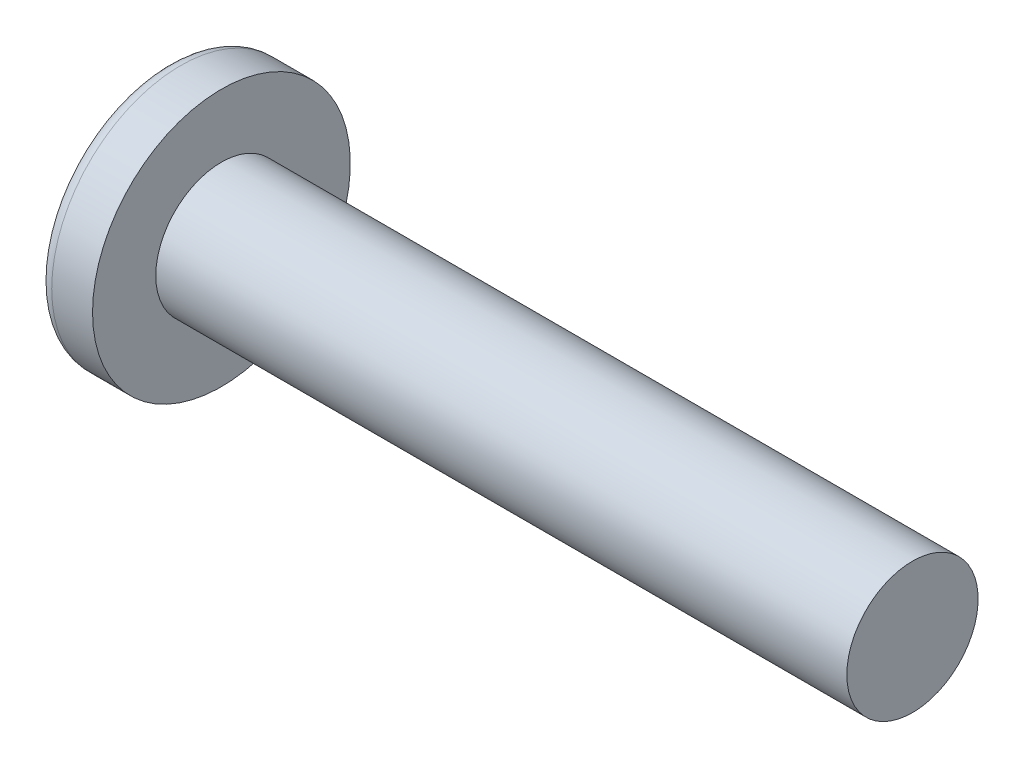
ISO-10303-21;
HEADER;
FILE_DESCRIPTION(('STEP AP214'),'2;1');
FILE_NAME('part.step','',(''),(''),'','','');
FILE_SCHEMA(('AUTOMOTIVE_DESIGN { 1 0 10303 214 1 1 1 1 }'));
ENDSEC;
DATA;
#1=APPLICATION_CONTEXT('core data for automotive mechanical design processes');
#2=APPLICATION_PROTOCOL_DEFINITION('international standard','automotive_design',2000,#1);
#3=PRODUCT_CONTEXT('',#1,'mechanical');
#4=PRODUCT('Part','Part','',(#3));
#5=PRODUCT_RELATED_PRODUCT_CATEGORY('part','',(#4));
#6=PRODUCT_DEFINITION_FORMATION('','',#4);
#7=PRODUCT_DEFINITION_CONTEXT('part definition',#1,'design');
#8=PRODUCT_DEFINITION('design','',#6,#7);
#9=PRODUCT_DEFINITION_SHAPE('','',#8);
#10=(LENGTH_UNIT() NAMED_UNIT(*) SI_UNIT(.MILLI.,.METRE.));
#11=(NAMED_UNIT(*) PLANE_ANGLE_UNIT() SI_UNIT($,.RADIAN.));
#12=(NAMED_UNIT(*) SI_UNIT($,.STERADIAN.) SOLID_ANGLE_UNIT());
#13=UNCERTAINTY_MEASURE_WITH_UNIT(LENGTH_MEASURE(1.E-05),#10,'distance_accuracy_value','');
#14=(GEOMETRIC_REPRESENTATION_CONTEXT(3) GLOBAL_UNCERTAINTY_ASSIGNED_CONTEXT((#13)) GLOBAL_UNIT_ASSIGNED_CONTEXT((#10,
#11,#12)) REPRESENTATION_CONTEXT('',''));
#15=CARTESIAN_POINT('',(0.,0.,0.));
#16=DIRECTION('',(0.,0.,1.));
#17=DIRECTION('',(1.,0.,0.));
#18=AXIS2_PLACEMENT_3D('',#15,#16,#17);
#19=CARTESIAN_POINT('',(7.7216,0.,0.));
#20=DIRECTION('',(-1.,0.,0.));
#21=DIRECTION('',(0.,1.,0.));
#22=AXIS2_PLACEMENT_3D('',#19,#20,#21);
#23=SPHERICAL_SURFACE('',#22,7.7216);
#24=CARTESIAN_POINT('',(1.46619704189251,0.,0.));
#25=DIRECTION('',(-1.,0.,0.));
#26=DIRECTION('',(0.,0.,1.));
#27=AXIS2_PLACEMENT_3D('',#24,#25,#26);
#28=CIRCLE('',#27,4.52692394366197);
#29=CARTESIAN_POINT('',(1.46619704189251,0.,4.52692394366197));
#30=VERTEX_POINT('',#29);
#31=EDGE_CURVE('E153',#30,#30,#28,.T.);
#32=ORIENTED_EDGE('',*,*,#31,.T.);
#33=EDGE_LOOP('',(#32));
#34=FACE_BOUND('',#33,.T.);
#35=CARTESIAN_POINT('',(7.71626836849415,-0.0635159579392896,0.));
#36=DIRECTION('',(-0.0836474251843073,-0.996495413065226,0.));
#37=DIRECTION('',(0.996495413065226,-0.0836474251843073,0.));
#38=AXIS2_PLACEMENT_3D('',#35,#36,#37);
#39=CIRCLE('',#38,7.72133692159541);
#40=CARTESIAN_POINT('',(0.492297297865042,0.542875774266794,2.65811491373462));
#41=VERTEX_POINT('',#40);
#42=CARTESIAN_POINT('',(0.0437691983649017,0.580525943202944,0.580525943202946));
#43=VERTEX_POINT('',#42);
#44=EDGE_CURVE('E184',#41,#43,#39,.T.);
#45=ORIENTED_EDGE('',*,*,#44,.F.);
#46=CARTESIAN_POINT('',(6.22874657717022,0.,-1.88498542790488));
#47=DIRECTION('',(0.620849497837048,0.,0.783929780679038));
#48=DIRECTION('',(0.783929780679038,0.,-0.620849497837048));
#49=AXIS2_PLACEMENT_3D('',#46,#47,#48);
#50=CIRCLE('',#49,7.33766482980326);
#51=CARTESIAN_POINT('',(0.492297297865042,-0.542875774266812,2.65811491373462));
#52=VERTEX_POINT('',#51);
#53=EDGE_CURVE('E149',#41,#52,#50,.T.);
#54=ORIENTED_EDGE('',*,*,#53,.T.);
#55=CARTESIAN_POINT('',(7.71626836849415,0.0635159579392893,0.));
#56=DIRECTION('',(-0.0836474251843072,0.996495413065226,0.));
#57=DIRECTION('',(-0.996495413065226,-0.0836474251843072,0.));
#58=AXIS2_PLACEMENT_3D('',#55,#56,#57);
#59=CIRCLE('',#58,7.72133692159541);
#60=CARTESIAN_POINT('',(0.0437691983649017,-0.580525943202948,0.580525943202946));
#61=VERTEX_POINT('',#60);
#62=EDGE_CURVE('E105',#61,#52,#59,.T.);
#63=ORIENTED_EDGE('',*,*,#62,.F.);
#64=CARTESIAN_POINT('',(7.71626836849415,0.,-0.0635159579392893));
#65=DIRECTION('',(-0.0836474251843072,0.,-0.996495413065226));
#66=DIRECTION('',(-0.996495413065226,0.,0.0836474251843072));
#67=AXIS2_PLACEMENT_3D('',#64,#65,#66);
#68=CIRCLE('',#67,7.72133692159541);
#69=CARTESIAN_POINT('',(0.492297297865041,-2.65811491373462,0.542875774266802));
#70=VERTEX_POINT('',#69);
#71=EDGE_CURVE('E130',#70,#61,#68,.T.);
#72=ORIENTED_EDGE('',*,*,#71,.F.);
#73=CARTESIAN_POINT('',(6.22874657717022,1.88498542790488,0.));
#74=DIRECTION('',(0.620849497837048,-0.783929780679038,0.));
#75=DIRECTION('',(0.783929780679038,0.620849497837048,0.));
#76=AXIS2_PLACEMENT_3D('',#73,#74,#75);
#77=CIRCLE('',#76,7.33766482980326);
#78=CARTESIAN_POINT('',(0.492297297865041,-2.65811491373462,-0.542875774266803));
#79=VERTEX_POINT('',#78);
#80=EDGE_CURVE('E138',#70,#79,#77,.T.);
#81=ORIENTED_EDGE('',*,*,#80,.T.);
#82=CARTESIAN_POINT('',(7.71626836849415,0.,0.0635159579392897));
#83=DIRECTION('',(-0.0836474251843073,0.,0.996495413065226));
#84=DIRECTION('',(0.996495413065226,0.,0.0836474251843073));
#85=AXIS2_PLACEMENT_3D('',#82,#83,#84);
#86=CIRCLE('',#85,7.72133692159541);
#87=CARTESIAN_POINT('',(0.0437691983649017,-0.580525943202944,-0.580525943202946));
#88=VERTEX_POINT('',#87);
#89=EDGE_CURVE('E48',#88,#79,#86,.T.);
#90=ORIENTED_EDGE('',*,*,#89,.F.);
#91=CARTESIAN_POINT('',(0.492297297865041,-0.542875774266793,-2.65811491373462));
#92=VERTEX_POINT('',#91);
#93=EDGE_CURVE('E191',#92,#88,#59,.T.);
#94=ORIENTED_EDGE('',*,*,#93,.F.);
#95=CARTESIAN_POINT('',(6.22874657717022,0.,1.88498542790488));
#96=DIRECTION('',(0.620849497837048,0.,-0.783929780679038));
#97=DIRECTION('',(-0.783929780679038,0.,-0.620849497837048));
#98=AXIS2_PLACEMENT_3D('',#95,#96,#97);
#99=CIRCLE('',#98,7.33766482980326);
#100=CARTESIAN_POINT('',(0.492297297865041,0.542875774266812,-2.65811491373462));
#101=VERTEX_POINT('',#100);
#102=EDGE_CURVE('E131',#92,#101,#99,.T.);
#103=ORIENTED_EDGE('',*,*,#102,.T.);
#104=CARTESIAN_POINT('',(0.0437691983649017,0.580525943202948,-0.580525943202946));
#105=VERTEX_POINT('',#104);
#106=EDGE_CURVE('E179',#105,#101,#39,.T.);
#107=ORIENTED_EDGE('',*,*,#106,.F.);
#108=CARTESIAN_POINT('',(0.492297297865042,2.65811491373462,-0.542875774266803));
#109=VERTEX_POINT('',#108);
#110=EDGE_CURVE('E41',#109,#105,#86,.T.);
#111=ORIENTED_EDGE('',*,*,#110,.F.);
#112=CARTESIAN_POINT('',(6.22874657717022,-1.88498542790488,0.));
#113=DIRECTION('',(0.620849497837048,0.783929780679038,0.));
#114=DIRECTION('',(-0.783929780679038,0.620849497837048,0.));
#115=AXIS2_PLACEMENT_3D('',#112,#113,#114);
#116=CIRCLE('',#115,7.33766482980326);
#117=CARTESIAN_POINT('',(0.492297297865042,2.65811491373462,0.542875774266803));
#118=VERTEX_POINT('',#117);
#119=EDGE_CURVE('E11',#109,#118,#116,.T.);
#120=ORIENTED_EDGE('',*,*,#119,.T.);
#121=EDGE_CURVE('E167',#43,#118,#68,.T.);
#122=ORIENTED_EDGE('',*,*,#121,.F.);
#123=EDGE_LOOP('',(#45,#54,#63,#72,#81,#90,#94,#103,#107,#111,#120,#122));
#124=FACE_BOUND('',#123,.T.);
#125=ADVANCED_FACE('F33',(#34,#124),#23,.T.);
#126=CARTESIAN_POINT('',(3.8486267281106,0.,-0.261140092165899));
#127=DIRECTION('',(-0.0836474251843073,0.,0.996495413065226));
#128=DIRECTION('',(0.996495413065226,0.,0.0836474251843073));
#129=AXIS2_PLACEMENT_3D('',#126,#127,#128);
#130=PLANE('',#129);
#131=ORIENTED_EDGE('',*,*,#110,.T.);
#132=DIRECTION('',(0.993027416127926,-0.0833563159523445,0.0833563159523442));
#133=VECTOR('',#132,1.);
#134=CARTESIAN_POINT('',(3.87024262719418,0.259325618885161,-0.25932561888516));
#135=LINE('',#134,#133);
#136=CARTESIAN_POINT('',(3.4798,0.292100000000001,-0.292099999999999));
#137=VERTEX_POINT('',#136);
#138=EDGE_CURVE('E173',#105,#137,#135,.T.);
#139=ORIENTED_EDGE('',*,*,#138,.T.);
#140=DIRECTION('',(0.782237983126563,-0.619509643571037,0.0656623124522297));
#141=VECTOR('',#140,1.);
#142=CARTESIAN_POINT('',(0.,3.048,-0.5842));
#143=LINE('',#142,#141);
#144=EDGE_CURVE('E154',#109,#137,#143,.T.);
#145=ORIENTED_EDGE('',*,*,#144,.F.);
#146=EDGE_LOOP('',(#131,#139,#145));
#147=FACE_BOUND('',#146,.T.);
#148=ADVANCED_FACE('F172',(#147),#130,.T.);
#149=DIRECTION('',(0.782237983126563,0.619509643571037,0.0656623124522297));
#150=VECTOR('',#149,1.);
#151=CARTESIAN_POINT('',(0.,-3.048,-0.5842));
#152=LINE('',#151,#150);
#153=CARTESIAN_POINT('',(3.4798,-0.2921,-0.2921));
#154=VERTEX_POINT('',#153);
#155=EDGE_CURVE('E139',#79,#154,#152,.T.);
#156=ORIENTED_EDGE('',*,*,#155,.T.);
#157=DIRECTION('',(-0.993027416127926,-0.0833563159523438,-0.0833563159523442));
#158=VECTOR('',#157,1.);
#159=CARTESIAN_POINT('',(3.87024262719418,-0.259325618885159,-0.25932561888516));
#160=LINE('',#159,#158);
#161=EDGE_CURVE('E194',#154,#88,#160,.T.);
#162=ORIENTED_EDGE('',*,*,#161,.T.);
#163=ORIENTED_EDGE('',*,*,#89,.T.);
#164=EDGE_LOOP('',(#156,#162,#163));
#165=FACE_BOUND('',#164,.T.);
#166=ADVANCED_FACE('F209',(#165),#130,.T.);
#167=CARTESIAN_POINT('',(3.8486267281106,0.,0.261140092165899));
#168=DIRECTION('',(-0.0836474251843072,0.,-0.996495413065226));
#169=DIRECTION('',(-0.996495413065226,0.,0.0836474251843072));
#170=AXIS2_PLACEMENT_3D('',#167,#168,#169);
#171=PLANE('',#170);
#172=DIRECTION('',(0.782237983126563,-0.619509643571037,-0.0656623124522297));
#173=VECTOR('',#172,1.);
#174=CARTESIAN_POINT('',(0.,3.048,0.5842));
#175=LINE('',#174,#173);
#176=CARTESIAN_POINT('',(3.4798,0.2921,0.2921));
#177=VERTEX_POINT('',#176);
#178=EDGE_CURVE('E210',#118,#177,#175,.T.);
#179=ORIENTED_EDGE('',*,*,#178,.T.);
#180=DIRECTION('',(-0.993027416127926,0.0833563159523439,0.0833563159523441));
#181=VECTOR('',#180,1.);
#182=CARTESIAN_POINT('',(3.87024262719418,0.259325618885159,0.25932561888516));
#183=LINE('',#182,#181);
#184=EDGE_CURVE('E188',#177,#43,#183,.T.);
#185=ORIENTED_EDGE('',*,*,#184,.T.);
#186=ORIENTED_EDGE('',*,*,#121,.T.);
#187=EDGE_LOOP('',(#179,#185,#186));
#188=FACE_BOUND('',#187,.T.);
#189=ADVANCED_FACE('F214',(#188),#171,.T.);
#190=ORIENTED_EDGE('',*,*,#71,.T.);
#191=DIRECTION('',(0.993027416127926,0.0833563159523444,-0.0833563159523441));
#192=VECTOR('',#191,1.);
#193=CARTESIAN_POINT('',(3.87024262719418,-0.259325618885161,0.25932561888516));
#194=LINE('',#193,#192);
#195=CARTESIAN_POINT('',(3.4798,-0.292100000000001,0.292099999999999));
#196=VERTEX_POINT('',#195);
#197=EDGE_CURVE('E103',#61,#196,#194,.T.);
#198=ORIENTED_EDGE('',*,*,#197,.T.);
#199=DIRECTION('',(0.782237983126563,0.619509643571037,-0.0656623124522295));
#200=VECTOR('',#199,1.);
#201=CARTESIAN_POINT('',(0.,-3.048,0.584199999999999));
#202=LINE('',#201,#200);
#203=EDGE_CURVE('E128',#70,#196,#202,.T.);
#204=ORIENTED_EDGE('',*,*,#203,.F.);
#205=EDGE_LOOP('',(#190,#198,#204));
#206=FACE_BOUND('',#205,.T.);
#207=ADVANCED_FACE('F127',(#206),#171,.T.);
#208=CARTESIAN_POINT('',(-25.4,0.,0.));
#209=DIRECTION('',(-1.,0.,0.));
#210=DIRECTION('',(0.,0.,1.));
#211=AXIS2_PLACEMENT_3D('',#208,#209,#210);
#212=CYLINDRICAL_SURFACE('',#211,2.413);
#213=CARTESIAN_POINT('',(28.7782,0.,0.));
#214=DIRECTION('',(-1.,0.,0.));
#215=DIRECTION('',(0.,0.,1.));
#216=AXIS2_PLACEMENT_3D('',#213,#214,#215);
#217=CIRCLE('',#216,2.413);
#218=CARTESIAN_POINT('',(28.7782,0.,2.413));
#219=VERTEX_POINT('',#218);
#220=EDGE_CURVE('E150',#219,#219,#217,.T.);
#221=ORIENTED_EDGE('',*,*,#220,.T.);
#222=EDGE_LOOP('',(#221));
#223=FACE_BOUND('',#222,.T.);
#224=CARTESIAN_POINT('',(3.3782,0.,0.));
#225=DIRECTION('',(-1.,0.,0.));
#226=DIRECTION('',(0.,0.,1.));
#227=AXIS2_PLACEMENT_3D('',#224,#225,#226);
#228=CIRCLE('',#227,2.413);
#229=CARTESIAN_POINT('',(3.3782,0.,2.413));
#230=VERTEX_POINT('',#229);
#231=EDGE_CURVE('E163',#230,#230,#228,.T.);
#232=ORIENTED_EDGE('',*,*,#231,.F.);
#233=EDGE_LOOP('',(#232));
#234=FACE_BOUND('',#233,.T.);
#235=ADVANCED_FACE('F35',(#223,#234),#212,.T.);
#236=CARTESIAN_POINT('',(3.3782,2.413,0.));
#237=DIRECTION('',(-1.,0.,0.));
#238=DIRECTION('',(0.,0.,1.));
#239=AXIS2_PLACEMENT_3D('',#236,#237,#238);
#240=PLANE('',#239);
#241=CARTESIAN_POINT('',(3.3782,0.,0.));
#242=DIRECTION('',(-1.,0.,0.));
#243=DIRECTION('',(0.,0.,1.));
#244=AXIS2_PLACEMENT_3D('',#241,#242,#243);
#245=CIRCLE('',#244,4.7371);
#246=CARTESIAN_POINT('',(3.3782,0.,4.7371));
#247=VERTEX_POINT('',#246);
#248=EDGE_CURVE('E160',#247,#247,#245,.T.);
#249=ORIENTED_EDGE('',*,*,#248,.F.);
#250=EDGE_LOOP('',(#249));
#251=FACE_BOUND('',#250,.T.);
#252=ORIENTED_EDGE('',*,*,#231,.T.);
#253=EDGE_LOOP('',(#252));
#254=FACE_BOUND('',#253,.T.);
#255=ADVANCED_FACE('F242',(#251,#254),#240,.F.);
#256=CARTESIAN_POINT('',(-25.4,0.,0.));
#257=DIRECTION('',(-1.,0.,0.));
#258=DIRECTION('',(0.,0.,1.));
#259=AXIS2_PLACEMENT_3D('',#256,#257,#258);
#260=CYLINDRICAL_SURFACE('',#259,4.7371);
#261=ORIENTED_EDGE('',*,*,#248,.T.);
#262=EDGE_LOOP('',(#261));
#263=FACE_BOUND('',#262,.T.);
#264=CARTESIAN_POINT('',(1.87773671018905,0.,0.));
#265=DIRECTION('',(-1.,0.,0.));
#266=DIRECTION('',(0.,0.,1.));
#267=AXIS2_PLACEMENT_3D('',#264,#265,#266);
#268=CIRCLE('',#267,4.7371);
#269=CARTESIAN_POINT('',(1.87773671018905,0.,4.7371));
#270=VERTEX_POINT('',#269);
#271=EDGE_CURVE('E157',#270,#270,#268,.T.);
#272=ORIENTED_EDGE('',*,*,#271,.F.);
#273=EDGE_LOOP('',(#272));
#274=FACE_BOUND('',#273,.T.);
#275=ADVANCED_FACE('F239',(#263,#274),#260,.T.);
#276=CARTESIAN_POINT('',(1.87773671018906,0.,0.));
#277=DIRECTION('',(-1.,0.,0.));
#278=DIRECTION('',(0.,0.,1.));
#279=AXIS2_PLACEMENT_3D('',#276,#277,#278);
#280=TOROIDAL_SURFACE('',#279,4.2291,0.507999999999999);
#281=ORIENTED_EDGE('',*,*,#271,.T.);
#282=EDGE_LOOP('',(#281));
#283=FACE_BOUND('',#282,.T.);
#284=ORIENTED_EDGE('',*,*,#31,.F.);
#285=EDGE_LOOP('',(#284));
#286=FACE_BOUND('',#285,.T.);
#287=ADVANCED_FACE('F236',(#283,#286),#280,.T.);
#288=CARTESIAN_POINT('',(28.7782,2.413,0.));
#289=DIRECTION('',(1.,0.,0.));
#290=DIRECTION('',(0.,0.,-1.));
#291=AXIS2_PLACEMENT_3D('',#288,#289,#290);
#292=PLANE('',#291);
#293=ORIENTED_EDGE('',*,*,#220,.F.);
#294=EDGE_LOOP('',(#293));
#295=FACE_BOUND('',#294,.T.);
#296=ADVANCED_FACE('F234',(#295),#292,.T.);
#297=CARTESIAN_POINT('',(3.4798,0.2921,0.2921));
#298=DIRECTION('',(0.620849497837048,0.783929780679038,0.));
#299=DIRECTION('',(-0.783929780679038,0.620849497837048,0.));
#300=AXIS2_PLACEMENT_3D('',#297,#298,#299);
#301=PLANE('',#300);
#302=ORIENTED_EDGE('',*,*,#144,.T.);
#303=DIRECTION('',(0.,0.,-1.));
#304=VECTOR('',#303,1.);
#305=CARTESIAN_POINT('',(3.4798,0.2921,0.2921));
#306=LINE('',#305,#304);
#307=EDGE_CURVE('E121',#177,#137,#306,.T.);
#308=ORIENTED_EDGE('',*,*,#307,.F.);
#309=ORIENTED_EDGE('',*,*,#178,.F.);
#310=ORIENTED_EDGE('',*,*,#119,.F.);
#311=EDGE_LOOP('',(#302,#308,#309,#310));
#312=FACE_BOUND('',#311,.T.);
#313=ADVANCED_FACE('F213',(#312),#301,.F.);
#314=CARTESIAN_POINT('',(3.4798,-0.2921,-0.2921));
#315=DIRECTION('',(0.620849497837048,-0.783929780679038,0.));
#316=DIRECTION('',(0.783929780679038,0.620849497837048,0.));
#317=AXIS2_PLACEMENT_3D('',#314,#315,#316);
#318=PLANE('',#317);
#319=ORIENTED_EDGE('',*,*,#203,.T.);
#320=DIRECTION('',(0.,0.,1.));
#321=VECTOR('',#320,1.);
#322=CARTESIAN_POINT('',(3.4798,-0.2921,-0.2921));
#323=LINE('',#322,#321);
#324=EDGE_CURVE('E120',#154,#196,#323,.T.);
#325=ORIENTED_EDGE('',*,*,#324,.F.);
#326=ORIENTED_EDGE('',*,*,#155,.F.);
#327=ORIENTED_EDGE('',*,*,#80,.F.);
#328=EDGE_LOOP('',(#319,#325,#326,#327));
#329=FACE_BOUND('',#328,.T.);
#330=ADVANCED_FACE('F135',(#329),#318,.F.);
#331=CARTESIAN_POINT('',(3.4798,0.2921,-0.2921));
#332=DIRECTION('',(-1.,0.,0.));
#333=DIRECTION('',(0.,0.,1.));
#334=AXIS2_PLACEMENT_3D('',#331,#332,#333);
#335=PLANE('',#334);
#336=DIRECTION('',(0.,1.,0.));
#337=VECTOR('',#336,1.);
#338=CARTESIAN_POINT('',(3.4798,-0.2921,-0.2921));
#339=LINE('',#338,#337);
#340=EDGE_CURVE('E143',#154,#137,#339,.T.);
#341=ORIENTED_EDGE('',*,*,#340,.F.);
#342=ORIENTED_EDGE('',*,*,#324,.T.);
#343=DIRECTION('',(0.,-1.,0.));
#344=VECTOR('',#343,1.);
#345=CARTESIAN_POINT('',(3.4798,0.2921,0.2921));
#346=LINE('',#345,#344);
#347=EDGE_CURVE('E112',#177,#196,#346,.T.);
#348=ORIENTED_EDGE('',*,*,#347,.F.);
#349=ORIENTED_EDGE('',*,*,#307,.T.);
#350=EDGE_LOOP('',(#341,#342,#348,#349));
#351=FACE_BOUND('',#350,.T.);
#352=ADVANCED_FACE('F141',(#351),#335,.T.);
#353=CARTESIAN_POINT('',(3.4798,0.292100000000001,-0.292099999999999));
#354=DIRECTION('',(0.620849497837048,0.,-0.783929780679038));
#355=DIRECTION('',(0.783929780679038,0.,0.620849497837048));
#356=AXIS2_PLACEMENT_3D('',#353,#354,#355);
#357=PLANE('',#356);
#358=DIRECTION('',(0.782237983126563,0.0656623124522274,0.619509643571037));
#359=VECTOR('',#358,1.);
#360=CARTESIAN_POINT('',(0.,-0.584199999999989,-3.048));
#361=LINE('',#360,#359);
#362=EDGE_CURVE('E199',#92,#154,#361,.T.);
#363=ORIENTED_EDGE('',*,*,#362,.T.);
#364=ORIENTED_EDGE('',*,*,#340,.T.);
#365=DIRECTION('',(0.782237983126563,-0.0656623124522319,0.619509643571037));
#366=VECTOR('',#365,1.);
#367=CARTESIAN_POINT('',(0.,0.584200000000011,-3.048));
#368=LINE('',#367,#366);
#369=EDGE_CURVE('E109',#101,#137,#368,.T.);
#370=ORIENTED_EDGE('',*,*,#369,.F.);
#371=ORIENTED_EDGE('',*,*,#102,.F.);
#372=EDGE_LOOP('',(#363,#364,#370,#371));
#373=FACE_BOUND('',#372,.T.);
#374=ADVANCED_FACE('F204',(#373),#357,.F.);
#375=CARTESIAN_POINT('',(3.8486267281106,-0.261140092165899,0.));
#376=DIRECTION('',(-0.0836474251843072,0.996495413065226,0.));
#377=DIRECTION('',(-0.996495413065226,-0.0836474251843072,0.));
#378=AXIS2_PLACEMENT_3D('',#375,#376,#377);
#379=PLANE('',#378);
#380=ORIENTED_EDGE('',*,*,#93,.T.);
#381=ORIENTED_EDGE('',*,*,#161,.F.);
#382=ORIENTED_EDGE('',*,*,#362,.F.);
#383=EDGE_LOOP('',(#380,#381,#382));
#384=FACE_BOUND('',#383,.T.);
#385=ADVANCED_FACE('F208',(#384),#379,.T.);
#386=CARTESIAN_POINT('',(3.8486267281106,0.261140092165899,0.));
#387=DIRECTION('',(-0.0836474251843073,-0.996495413065226,0.));
#388=DIRECTION('',(0.996495413065226,-0.0836474251843073,0.));
#389=AXIS2_PLACEMENT_3D('',#386,#387,#388);
#390=PLANE('',#389);
#391=ORIENTED_EDGE('',*,*,#106,.T.);
#392=ORIENTED_EDGE('',*,*,#369,.T.);
#393=ORIENTED_EDGE('',*,*,#138,.F.);
#394=EDGE_LOOP('',(#391,#392,#393));
#395=FACE_BOUND('',#394,.T.);
#396=ADVANCED_FACE('F202',(#395),#390,.T.);
#397=CARTESIAN_POINT('',(3.4798,-0.292100000000001,0.292099999999999));
#398=DIRECTION('',(0.620849497837048,0.,0.783929780679038));
#399=DIRECTION('',(-0.783929780679038,0.,0.620849497837048));
#400=AXIS2_PLACEMENT_3D('',#397,#398,#399);
#401=PLANE('',#400);
#402=DIRECTION('',(0.782237983126563,-0.0656623124522275,-0.619509643571037));
#403=VECTOR('',#402,1.);
#404=CARTESIAN_POINT('',(0.,0.584199999999989,3.048));
#405=LINE('',#404,#403);
#406=EDGE_CURVE('E108',#41,#177,#405,.T.);
#407=ORIENTED_EDGE('',*,*,#406,.T.);
#408=ORIENTED_EDGE('',*,*,#347,.T.);
#409=DIRECTION('',(0.782237983126563,0.0656623124522319,-0.619509643571037));
#410=VECTOR('',#409,1.);
#411=CARTESIAN_POINT('',(0.,-0.584200000000011,3.048));
#412=LINE('',#411,#410);
#413=EDGE_CURVE('E99',#52,#196,#412,.T.);
#414=ORIENTED_EDGE('',*,*,#413,.F.);
#415=ORIENTED_EDGE('',*,*,#53,.F.);
#416=EDGE_LOOP('',(#407,#408,#414,#415));
#417=FACE_BOUND('',#416,.T.);
#418=ADVANCED_FACE('F113',(#417),#401,.F.);
#419=ORIENTED_EDGE('',*,*,#44,.T.);
#420=ORIENTED_EDGE('',*,*,#184,.F.);
#421=ORIENTED_EDGE('',*,*,#406,.F.);
#422=EDGE_LOOP('',(#419,#420,#421));
#423=FACE_BOUND('',#422,.T.);
#424=ADVANCED_FACE('F215',(#423),#390,.T.);
#425=ORIENTED_EDGE('',*,*,#62,.T.);
#426=ORIENTED_EDGE('',*,*,#413,.T.);
#427=ORIENTED_EDGE('',*,*,#197,.F.);
#428=EDGE_LOOP('',(#425,#426,#427));
#429=FACE_BOUND('',#428,.T.);
#430=ADVANCED_FACE('F101',(#429),#379,.T.);
#431=CLOSED_SHELL('',(#125,#148,#166,#189,#207,#235,#255,#275,#287,#296,#313,#330,#352,#374,
#385,#396,#418,#424,#430));
#432=MANIFOLD_SOLID_BREP('B2',#431);
#433=ADVANCED_BREP_SHAPE_REPRESENTATION('',(#18,#432),#14);
#434=SHAPE_DEFINITION_REPRESENTATION(#9,#433);
ENDSEC;
END-ISO-10303-21;
